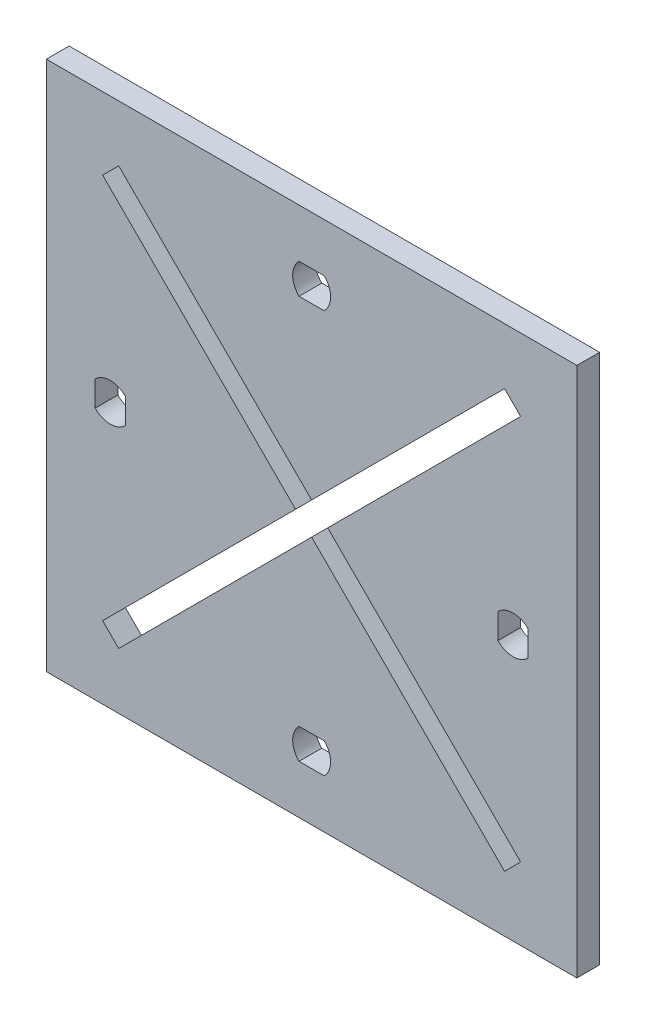
ISO-10303-21;
HEADER;
FILE_DESCRIPTION(('STEP AP214'),'2;1');
FILE_NAME('part.step','',(''),(''),'','','');
FILE_SCHEMA(('AUTOMOTIVE_DESIGN { 1 0 10303 214 1 1 1 1 }'));
ENDSEC;
DATA;
#1=APPLICATION_CONTEXT('core data for automotive mechanical design processes');
#2=APPLICATION_PROTOCOL_DEFINITION('international standard','automotive_design',2000,#1);
#3=PRODUCT_CONTEXT('',#1,'mechanical');
#4=PRODUCT('Part','Part','',(#3));
#5=PRODUCT_RELATED_PRODUCT_CATEGORY('part','',(#4));
#6=PRODUCT_DEFINITION_FORMATION('','',#4);
#7=PRODUCT_DEFINITION_CONTEXT('part definition',#1,'design');
#8=PRODUCT_DEFINITION('design','',#6,#7);
#9=PRODUCT_DEFINITION_SHAPE('','',#8);
#10=(LENGTH_UNIT() NAMED_UNIT(*) SI_UNIT(.MILLI.,.METRE.));
#11=(NAMED_UNIT(*) PLANE_ANGLE_UNIT() SI_UNIT($,.RADIAN.));
#12=(NAMED_UNIT(*) SI_UNIT($,.STERADIAN.) SOLID_ANGLE_UNIT());
#13=UNCERTAINTY_MEASURE_WITH_UNIT(LENGTH_MEASURE(1.E-05),#10,'distance_accuracy_value','');
#14=(GEOMETRIC_REPRESENTATION_CONTEXT(3) GLOBAL_UNCERTAINTY_ASSIGNED_CONTEXT((#13)) GLOBAL_UNIT_ASSIGNED_CONTEXT((#10,
#11,#12)) REPRESENTATION_CONTEXT('',''));
#15=CARTESIAN_POINT('',(0.,0.,0.));
#16=DIRECTION('',(0.,0.,1.));
#17=DIRECTION('',(1.,0.,0.));
#18=AXIS2_PLACEMENT_3D('',#15,#16,#17);
#19=CARTESIAN_POINT('',(26.9498063690037,0.,3.));
#20=DIRECTION('',(1.,0.,0.));
#21=DIRECTION('',(0.,0.,-1.));
#22=AXIS2_PLACEMENT_3D('',#19,#20,#21);
#23=PLANE('',#22);
#24=DIRECTION('',(0.,-1.,0.));
#25=VECTOR('',#24,1.);
#26=CARTESIAN_POINT('',(26.9498063690037,0.,0.));
#27=LINE('',#26,#25);
#28=CARTESIAN_POINT('',(26.9498063690037,-2.99948211574375,0.));
#29=VERTEX_POINT('',#28);
#30=CARTESIAN_POINT('',(26.9498063690037,-6.32849045633482,0.));
#31=VERTEX_POINT('',#30);
#32=EDGE_CURVE('E427',#29,#31,#27,.T.);
#33=ORIENTED_EDGE('',*,*,#32,.F.);
#34=DIRECTION('',(0.,0.,-1.));
#35=VECTOR('',#34,1.);
#36=CARTESIAN_POINT('',(26.9498063690037,-2.99948211574375,3.));
#37=LINE('',#36,#35);
#38=CARTESIAN_POINT('',(26.9498063690037,-2.99948211574375,3.));
#39=VERTEX_POINT('',#38);
#40=EDGE_CURVE('E11',#39,#29,#37,.T.);
#41=ORIENTED_EDGE('',*,*,#40,.F.);
#42=DIRECTION('',(0.,-1.,0.));
#43=VECTOR('',#42,1.);
#44=CARTESIAN_POINT('',(26.9498063690037,0.,3.));
#45=LINE('',#44,#43);
#46=CARTESIAN_POINT('',(26.9498063690037,-6.32849045633482,3.));
#47=VERTEX_POINT('',#46);
#48=EDGE_CURVE('E266',#39,#47,#45,.T.);
#49=ORIENTED_EDGE('',*,*,#48,.T.);
#50=DIRECTION('',(0.,0.,-1.));
#51=VECTOR('',#50,1.);
#52=CARTESIAN_POINT('',(26.9498063690037,-6.32849045633482,3.));
#53=LINE('',#52,#51);
#54=EDGE_CURVE('E56',#47,#31,#53,.T.);
#55=ORIENTED_EDGE('',*,*,#54,.T.);
#56=EDGE_LOOP('',(#33,#41,#49,#55));
#57=FACE_BOUND('',#56,.T.);
#58=ADVANCED_FACE('F37',(#57),#23,.T.);
#59=CARTESIAN_POINT('',(28.9498063690037,-4.97552233111767,3.));
#60=DIRECTION('',(0.,0.,-1.));
#61=DIRECTION('',(-1.,0.,0.));
#62=AXIS2_PLACEMENT_3D('',#59,#60,#61);
#63=CYLINDRICAL_SURFACE('',#62,2.81153604507839);
#64=CARTESIAN_POINT('',(28.9498063690037,-4.97552233111767,0.));
#65=DIRECTION('',(0.,0.,1.));
#66=DIRECTION('',(1.,0.,0.));
#67=AXIS2_PLACEMENT_3D('',#64,#65,#66);
#68=CIRCLE('',#67,2.81153604507839);
#69=CARTESIAN_POINT('',(30.9498063690037,-2.99948211574375,0.));
#70=VERTEX_POINT('',#69);
#71=EDGE_CURVE('E271',#29,#70,#68,.F.);
#72=ORIENTED_EDGE('',*,*,#71,.T.);
#73=DIRECTION('',(0.,0.,-1.));
#74=VECTOR('',#73,1.);
#75=CARTESIAN_POINT('',(30.9498063690037,-2.99948211574375,3.));
#76=LINE('',#75,#74);
#77=CARTESIAN_POINT('',(30.9498063690037,-2.99948211574375,3.));
#78=VERTEX_POINT('',#77);
#79=EDGE_CURVE('E47',#78,#70,#76,.T.);
#80=ORIENTED_EDGE('',*,*,#79,.F.);
#81=CARTESIAN_POINT('',(28.9498063690037,-4.97552233111767,3.));
#82=DIRECTION('',(0.,0.,1.));
#83=DIRECTION('',(1.,0.,0.));
#84=AXIS2_PLACEMENT_3D('',#81,#82,#83);
#85=CIRCLE('',#84,2.81153604507839);
#86=EDGE_CURVE('E261',#39,#78,#85,.F.);
#87=ORIENTED_EDGE('',*,*,#86,.F.);
#88=ORIENTED_EDGE('',*,*,#40,.T.);
#89=EDGE_LOOP('',(#72,#80,#87,#88));
#90=FACE_BOUND('',#89,.T.);
#91=ADVANCED_FACE('F269',(#90),#63,.F.);
#92=CARTESIAN_POINT('',(30.9498063690037,0.,3.));
#93=DIRECTION('',(1.,0.,0.));
#94=DIRECTION('',(0.,1.,0.));
#95=AXIS2_PLACEMENT_3D('',#92,#93,#94);
#96=PLANE('',#95);
#97=DIRECTION('',(0.,-1.,0.));
#98=VECTOR('',#97,1.);
#99=CARTESIAN_POINT('',(30.9498063690037,0.,0.));
#100=LINE('',#99,#98);
#101=CARTESIAN_POINT('',(30.9498063690037,-6.32849045633482,0.));
#102=VERTEX_POINT('',#101);
#103=EDGE_CURVE('E430',#70,#102,#100,.T.);
#104=ORIENTED_EDGE('',*,*,#103,.T.);
#105=DIRECTION('',(0.,0.,-1.));
#106=VECTOR('',#105,1.);
#107=CARTESIAN_POINT('',(30.9498063690037,-6.32849045633482,3.));
#108=LINE('',#107,#106);
#109=CARTESIAN_POINT('',(30.9498063690037,-6.32849045633482,3.));
#110=VERTEX_POINT('',#109);
#111=EDGE_CURVE('E154',#110,#102,#108,.T.);
#112=ORIENTED_EDGE('',*,*,#111,.F.);
#113=DIRECTION('',(0.,-1.,0.));
#114=VECTOR('',#113,1.);
#115=CARTESIAN_POINT('',(30.9498063690037,0.,3.));
#116=LINE('',#115,#114);
#117=EDGE_CURVE('E253',#78,#110,#116,.T.);
#118=ORIENTED_EDGE('',*,*,#117,.F.);
#119=ORIENTED_EDGE('',*,*,#79,.T.);
#120=EDGE_LOOP('',(#104,#112,#118,#119));
#121=FACE_BOUND('',#120,.T.);
#122=ADVANCED_FACE('F255',(#121),#96,.F.);
#123=CARTESIAN_POINT('',(37.3780317158852,0.,3.));
#124=DIRECTION('',(1.,0.,0.));
#125=DIRECTION('',(0.,0.,-1.));
#126=AXIS2_PLACEMENT_3D('',#123,#124,#125);
#127=PLANE('',#126);
#128=DIRECTION('',(0.,-1.,0.));
#129=VECTOR('',#128,1.);
#130=CARTESIAN_POINT('',(37.3780317158852,0.,0.));
#131=LINE('',#130,#129);
#132=CARTESIAN_POINT('',(37.3780317158852,30.3360137139607,0.));
#133=VERTEX_POINT('',#132);
#134=CARTESIAN_POINT('',(37.3780317158852,-39.6639862860393,0.));
#135=VERTEX_POINT('',#134);
#136=EDGE_CURVE('E415',#133,#135,#131,.T.);
#137=ORIENTED_EDGE('',*,*,#136,.F.);
#138=DIRECTION('',(0.,0.,-1.));
#139=VECTOR('',#138,1.);
#140=CARTESIAN_POINT('',(37.3780317158852,30.3360137139607,3.));
#141=LINE('',#140,#139);
#142=CARTESIAN_POINT('',(37.3780317158852,30.3360137139607,3.));
#143=VERTEX_POINT('',#142);
#144=EDGE_CURVE('E284',#143,#133,#141,.T.);
#145=ORIENTED_EDGE('',*,*,#144,.F.);
#146=DIRECTION('',(0.,-1.,0.));
#147=VECTOR('',#146,1.);
#148=CARTESIAN_POINT('',(37.3780317158852,0.,3.));
#149=LINE('',#148,#147);
#150=CARTESIAN_POINT('',(37.3780317158852,-39.6639862860393,3.));
#151=VERTEX_POINT('',#150);
#152=EDGE_CURVE('E492',#143,#151,#149,.T.);
#153=ORIENTED_EDGE('',*,*,#152,.T.);
#154=DIRECTION('',(0.,0.,-1.));
#155=VECTOR('',#154,1.);
#156=CARTESIAN_POINT('',(37.3780317158852,-39.6639862860393,3.));
#157=LINE('',#156,#155);
#158=EDGE_CURVE('E276',#151,#135,#157,.T.);
#159=ORIENTED_EDGE('',*,*,#158,.T.);
#160=EDGE_LOOP('',(#137,#145,#153,#159));
#161=FACE_BOUND('',#160,.T.);
#162=ADVANCED_FACE('F539',(#161),#127,.T.);
#163=CARTESIAN_POINT('',(0.,30.3360137139607,3.));
#164=DIRECTION('',(0.,1.,0.));
#165=DIRECTION('',(0.,0.,1.));
#166=AXIS2_PLACEMENT_3D('',#163,#164,#165);
#167=PLANE('',#166);
#168=DIRECTION('',(1.,0.,0.));
#169=VECTOR('',#168,1.);
#170=CARTESIAN_POINT('',(0.,30.3360137139607,0.));
#171=LINE('',#170,#169);
#172=CARTESIAN_POINT('',(-32.6219682841148,30.3360137139607,0.));
#173=VERTEX_POINT('',#172);
#174=EDGE_CURVE('E418',#173,#133,#171,.T.);
#175=ORIENTED_EDGE('',*,*,#174,.F.);
#176=DIRECTION('',(0.,0.,-1.));
#177=VECTOR('',#176,1.);
#178=CARTESIAN_POINT('',(-32.6219682841148,30.3360137139607,3.));
#179=LINE('',#178,#177);
#180=CARTESIAN_POINT('',(-32.6219682841148,30.3360137139607,3.));
#181=VERTEX_POINT('',#180);
#182=EDGE_CURVE('E282',#181,#173,#179,.T.);
#183=ORIENTED_EDGE('',*,*,#182,.F.);
#184=DIRECTION('',(1.,0.,0.));
#185=VECTOR('',#184,1.);
#186=CARTESIAN_POINT('',(0.,30.3360137139607,3.));
#187=LINE('',#186,#185);
#188=EDGE_CURVE('E495',#181,#143,#187,.T.);
#189=ORIENTED_EDGE('',*,*,#188,.T.);
#190=ORIENTED_EDGE('',*,*,#144,.T.);
#191=EDGE_LOOP('',(#175,#183,#189,#190));
#192=FACE_BOUND('',#191,.T.);
#193=ADVANCED_FACE('F535',(#192),#167,.T.);
#194=CARTESIAN_POINT('',(-32.6219682841148,0.,3.));
#195=DIRECTION('',(1.,0.,0.));
#196=DIRECTION('',(0.,1.,0.));
#197=AXIS2_PLACEMENT_3D('',#194,#195,#196);
#198=PLANE('',#197);
#199=DIRECTION('',(0.,-1.,0.));
#200=VECTOR('',#199,1.);
#201=CARTESIAN_POINT('',(-32.6219682841148,0.,0.));
#202=LINE('',#201,#200);
#203=CARTESIAN_POINT('',(-32.6219682841148,-39.6639862860393,0.));
#204=VERTEX_POINT('',#203);
#205=EDGE_CURVE('E421',#173,#204,#202,.T.);
#206=ORIENTED_EDGE('',*,*,#205,.T.);
#207=DIRECTION('',(0.,0.,-1.));
#208=VECTOR('',#207,1.);
#209=CARTESIAN_POINT('',(-32.6219682841148,-39.6639862860393,3.));
#210=LINE('',#209,#208);
#211=CARTESIAN_POINT('',(-32.6219682841148,-39.6639862860393,3.));
#212=VERTEX_POINT('',#211);
#213=EDGE_CURVE('E278',#212,#204,#210,.T.);
#214=ORIENTED_EDGE('',*,*,#213,.F.);
#215=DIRECTION('',(0.,-1.,0.));
#216=VECTOR('',#215,1.);
#217=CARTESIAN_POINT('',(-32.6219682841148,0.,3.));
#218=LINE('',#217,#216);
#219=EDGE_CURVE('E498',#181,#212,#218,.T.);
#220=ORIENTED_EDGE('',*,*,#219,.F.);
#221=ORIENTED_EDGE('',*,*,#182,.T.);
#222=EDGE_LOOP('',(#206,#214,#220,#221));
#223=FACE_BOUND('',#222,.T.);
#224=ADVANCED_FACE('F531',(#223),#198,.F.);
#225=CARTESIAN_POINT('',(4.58166917274206,-4.58166917274206,3.));
#226=DIRECTION('',(-0.707106781186547,0.707106781186547,0.));
#227=DIRECTION('',(-0.707106781186548,-0.707106781186548,0.));
#228=AXIS2_PLACEMENT_3D('',#225,#226,#227);
#229=PLANE('',#228);
#230=DIRECTION('',(0.707106781186548,0.707106781186548,0.));
#231=VECTOR('',#230,1.);
#232=CARTESIAN_POINT('',(4.58166917274206,-4.58166917274206,0.));
#233=LINE('',#232,#231);
#234=CARTESIAN_POINT('',(-23.0778124068305,-32.2411507523146,0.));
#235=VERTEX_POINT('',#234);
#236=CARTESIAN_POINT('',(2.37803171588518,-6.78530662959893,0.));
#237=VERTEX_POINT('',#236);
#238=EDGE_CURVE('E387',#235,#237,#233,.T.);
#239=ORIENTED_EDGE('',*,*,#238,.F.);
#240=DIRECTION('',(0.,0.,-1.));
#241=VECTOR('',#240,1.);
#242=CARTESIAN_POINT('',(-23.0778124068305,-32.2411507523146,3.));
#243=LINE('',#242,#241);
#244=CARTESIAN_POINT('',(-23.0778124068305,-32.2411507523146,3.));
#245=VERTEX_POINT('',#244);
#246=EDGE_CURVE('E279',#245,#235,#243,.T.);
#247=ORIENTED_EDGE('',*,*,#246,.F.);
#248=DIRECTION('',(0.707106781186548,0.707106781186548,0.));
#249=VECTOR('',#248,1.);
#250=CARTESIAN_POINT('',(4.58166917274206,-4.58166917274206,3.));
#251=LINE('',#250,#249);
#252=CARTESIAN_POINT('',(2.37803171588518,-6.78530662959893,3.));
#253=VERTEX_POINT('',#252);
#254=EDGE_CURVE('E465',#245,#253,#251,.T.);
#255=ORIENTED_EDGE('',*,*,#254,.T.);
#256=DIRECTION('',(0.,0.,-1.));
#257=VECTOR('',#256,1.);
#258=CARTESIAN_POINT('',(2.37803171588518,-6.78530662959893,3.));
#259=LINE('',#258,#257);
#260=EDGE_CURVE('E286',#253,#237,#259,.T.);
#261=ORIENTED_EDGE('',*,*,#260,.T.);
#262=EDGE_LOOP('',(#239,#247,#255,#261));
#263=FACE_BOUND('',#262,.T.);
#264=ADVANCED_FACE('F534',(#263),#229,.T.);
#265=CARTESIAN_POINT('',(-27.6594815795726,-27.6594815795726,3.));
#266=DIRECTION('',(0.707106781186548,0.707106781186547,0.));
#267=DIRECTION('',(-0.707106781186547,0.707106781186548,0.));
#268=AXIS2_PLACEMENT_3D('',#265,#266,#267);
#269=PLANE('',#268);
#270=DIRECTION('',(0.707106781186547,-0.707106781186548,0.));
#271=VECTOR('',#270,1.);
#272=CARTESIAN_POINT('',(-27.6594815795726,-27.6594815795726,0.));
#273=LINE('',#272,#271);
#274=CARTESIAN_POINT('',(-25.1991327503902,-30.119830408755,0.));
#275=VERTEX_POINT('',#274);
#276=EDGE_CURVE('E390',#275,#235,#273,.T.);
#277=ORIENTED_EDGE('',*,*,#276,.F.);
#278=DIRECTION('',(0.,0.,-1.));
#279=VECTOR('',#278,1.);
#280=CARTESIAN_POINT('',(-25.1991327503902,-30.119830408755,3.));
#281=LINE('',#280,#279);
#282=CARTESIAN_POINT('',(-25.1991327503902,-30.119830408755,3.));
#283=VERTEX_POINT('',#282);
#284=EDGE_CURVE('E311',#283,#275,#281,.T.);
#285=ORIENTED_EDGE('',*,*,#284,.F.);
#286=DIRECTION('',(0.707106781186547,-0.707106781186548,0.));
#287=VECTOR('',#286,1.);
#288=CARTESIAN_POINT('',(-27.6594815795726,-27.6594815795726,3.));
#289=LINE('',#288,#287);
#290=EDGE_CURVE('E468',#283,#245,#289,.T.);
#291=ORIENTED_EDGE('',*,*,#290,.T.);
#292=ORIENTED_EDGE('',*,*,#246,.T.);
#293=EDGE_LOOP('',(#277,#285,#291,#292));
#294=FACE_BOUND('',#293,.T.);
#295=ADVANCED_FACE('F576',(#294),#269,.T.);
#296=CARTESIAN_POINT('',(2.46034882918241,-2.46034882918241,3.));
#297=DIRECTION('',(0.707106781186547,-0.707106781186548,0.));
#298=DIRECTION('',(0.707106781186548,0.707106781186547,0.));
#299=AXIS2_PLACEMENT_3D('',#296,#297,#298);
#300=PLANE('',#299);
#301=DIRECTION('',(-0.707106781186548,-0.707106781186547,0.));
#302=VECTOR('',#301,1.);
#303=CARTESIAN_POINT('',(2.46034882918241,-2.46034882918241,0.));
#304=LINE('',#303,#302);
#305=CARTESIAN_POINT('',(0.25671137232553,-4.66398628603928,0.));
#306=VERTEX_POINT('',#305);
#307=EDGE_CURVE('E394',#306,#275,#304,.T.);
#308=ORIENTED_EDGE('',*,*,#307,.F.);
#309=DIRECTION('',(0.,0.,-1.));
#310=VECTOR('',#309,1.);
#311=CARTESIAN_POINT('',(0.25671137232553,-4.66398628603928,3.));
#312=LINE('',#311,#310);
#313=CARTESIAN_POINT('',(0.25671137232553,-4.66398628603928,3.));
#314=VERTEX_POINT('',#313);
#315=EDGE_CURVE('E309',#314,#306,#312,.T.);
#316=ORIENTED_EDGE('',*,*,#315,.F.);
#317=DIRECTION('',(-0.707106781186548,-0.707106781186547,0.));
#318=VECTOR('',#317,1.);
#319=CARTESIAN_POINT('',(2.46034882918241,-2.46034882918241,3.));
#320=LINE('',#319,#318);
#321=EDGE_CURVE('E472',#314,#283,#320,.T.);
#322=ORIENTED_EDGE('',*,*,#321,.T.);
#323=ORIENTED_EDGE('',*,*,#284,.T.);
#324=EDGE_LOOP('',(#308,#316,#322,#323));
#325=FACE_BOUND('',#324,.T.);
#326=ADVANCED_FACE('F571',(#325),#300,.T.);
#327=CARTESIAN_POINT('',(-2.20363745685688,-2.20363745685688,3.));
#328=DIRECTION('',(-0.707106781186547,-0.707106781186547,0.));
#329=DIRECTION('',(0.707106781186548,-0.707106781186548,0.));
#330=AXIS2_PLACEMENT_3D('',#327,#328,#329);
#331=PLANE('',#330);
#332=DIRECTION('',(-0.707106781186548,0.707106781186548,0.));
#333=VECTOR('',#332,1.);
#334=CARTESIAN_POINT('',(-2.20363745685688,-2.20363745685688,0.));
#335=LINE('',#334,#333);
#336=CARTESIAN_POINT('',(-25.1991327503902,20.7918578366764,0.));
#337=VERTEX_POINT('',#336);
#338=EDGE_CURVE('E397',#306,#337,#335,.T.);
#339=ORIENTED_EDGE('',*,*,#338,.T.);
#340=DIRECTION('',(0.,0.,-1.));
#341=VECTOR('',#340,1.);
#342=CARTESIAN_POINT('',(-25.1991327503902,20.7918578366764,3.));
#343=LINE('',#342,#341);
#344=CARTESIAN_POINT('',(-25.1991327503902,20.7918578366764,3.));
#345=VERTEX_POINT('',#344);
#346=EDGE_CURVE('E306',#345,#337,#343,.T.);
#347=ORIENTED_EDGE('',*,*,#346,.F.);
#348=DIRECTION('',(-0.707106781186548,0.707106781186548,0.));
#349=VECTOR('',#348,1.);
#350=CARTESIAN_POINT('',(-2.20363745685688,-2.20363745685688,3.));
#351=LINE('',#350,#349);
#352=EDGE_CURVE('E475',#314,#345,#351,.T.);
#353=ORIENTED_EDGE('',*,*,#352,.F.);
#354=ORIENTED_EDGE('',*,*,#315,.T.);
#355=EDGE_LOOP('',(#339,#347,#353,#354));
#356=FACE_BOUND('',#355,.T.);
#357=ADVANCED_FACE('F548',(#356),#331,.F.);
#358=CARTESIAN_POINT('',(-22.9954952935333,22.9954952935333,3.));
#359=DIRECTION('',(-0.707106781186548,0.707106781186547,0.));
#360=DIRECTION('',(-0.707106781186547,-0.707106781186548,0.));
#361=AXIS2_PLACEMENT_3D('',#358,#359,#360);
#362=PLANE('',#361);
#363=DIRECTION('',(0.707106781186547,0.707106781186548,0.));
#364=VECTOR('',#363,1.);
#365=CARTESIAN_POINT('',(-22.9954952935333,22.9954952935333,0.));
#366=LINE('',#365,#364);
#367=CARTESIAN_POINT('',(-23.0778124068306,22.9131781802361,0.));
#368=VERTEX_POINT('',#367);
#369=EDGE_CURVE('E401',#337,#368,#366,.T.);
#370=ORIENTED_EDGE('',*,*,#369,.T.);
#371=DIRECTION('',(0.,0.,-1.));
#372=VECTOR('',#371,1.);
#373=CARTESIAN_POINT('',(-23.0778124068306,22.9131781802361,3.));
#374=LINE('',#373,#372);
#375=CARTESIAN_POINT('',(-23.0778124068306,22.9131781802361,3.));
#376=VERTEX_POINT('',#375);
#377=EDGE_CURVE('E303',#376,#368,#374,.T.);
#378=ORIENTED_EDGE('',*,*,#377,.F.);
#379=DIRECTION('',(0.707106781186547,0.707106781186548,0.));
#380=VECTOR('',#379,1.);
#381=CARTESIAN_POINT('',(-22.9954952935333,22.9954952935333,3.));
#382=LINE('',#381,#380);
#383=EDGE_CURVE('E479',#345,#376,#382,.T.);
#384=ORIENTED_EDGE('',*,*,#383,.F.);
#385=ORIENTED_EDGE('',*,*,#346,.T.);
#386=EDGE_LOOP('',(#370,#378,#384,#385));
#387=FACE_BOUND('',#386,.T.);
#388=ADVANCED_FACE('F572',(#387),#362,.F.);
#389=CARTESIAN_POINT('',(-0.0823171132972328,-0.0823171132972329,3.));
#390=DIRECTION('',(0.707106781186547,0.707106781186548,0.));
#391=DIRECTION('',(-0.707106781186548,0.707106781186547,0.));
#392=AXIS2_PLACEMENT_3D('',#389,#390,#391);
#393=PLANE('',#392);
#394=DIRECTION('',(0.707106781186548,-0.707106781186547,0.));
#395=VECTOR('',#394,1.);
#396=CARTESIAN_POINT('',(-0.0823171132972328,-0.0823171132972329,0.));
#397=LINE('',#396,#395);
#398=CARTESIAN_POINT('',(2.37803171588518,-2.54266594247964,0.));
#399=VERTEX_POINT('',#398);
#400=EDGE_CURVE('E405',#368,#399,#397,.T.);
#401=ORIENTED_EDGE('',*,*,#400,.T.);
#402=DIRECTION('',(0.,0.,-1.));
#403=VECTOR('',#402,1.);
#404=CARTESIAN_POINT('',(2.37803171588518,-2.54266594247964,3.));
#405=LINE('',#404,#403);
#406=CARTESIAN_POINT('',(2.37803171588518,-2.54266594247964,3.));
#407=VERTEX_POINT('',#406);
#408=EDGE_CURVE('E301',#407,#399,#405,.T.);
#409=ORIENTED_EDGE('',*,*,#408,.F.);
#410=DIRECTION('',(0.707106781186548,-0.707106781186547,0.));
#411=VECTOR('',#410,1.);
#412=CARTESIAN_POINT('',(-0.0823171132972328,-0.0823171132972329,3.));
#413=LINE('',#412,#411);
#414=EDGE_CURVE('E483',#376,#407,#413,.T.);
#415=ORIENTED_EDGE('',*,*,#414,.F.);
#416=ORIENTED_EDGE('',*,*,#377,.T.);
#417=EDGE_LOOP('',(#401,#409,#415,#416));
#418=FACE_BOUND('',#417,.T.);
#419=ADVANCED_FACE('F559',(#418),#393,.F.);
#420=CARTESIAN_POINT('',(27.8338758386009,22.9131781802361,0.));
#421=VERTEX_POINT('',#420);
#422=EDGE_CURVE('E398',#421,#399,#304,.T.);
#423=ORIENTED_EDGE('',*,*,#422,.F.);
#424=DIRECTION('',(0.,0.,-1.));
#425=VECTOR('',#424,1.);
#426=CARTESIAN_POINT('',(27.8338758386009,22.9131781802361,3.));
#427=LINE('',#426,#425);
#428=CARTESIAN_POINT('',(27.8338758386009,22.9131781802361,3.));
#429=VERTEX_POINT('',#428);
#430=EDGE_CURVE('E299',#429,#421,#427,.T.);
#431=ORIENTED_EDGE('',*,*,#430,.F.);
#432=EDGE_CURVE('E476',#429,#407,#320,.T.);
#433=ORIENTED_EDGE('',*,*,#432,.T.);
#434=ORIENTED_EDGE('',*,*,#408,.T.);
#435=EDGE_LOOP('',(#423,#431,#433,#434));
#436=FACE_BOUND('',#435,.T.);
#437=ADVANCED_FACE('F566',(#436),#300,.T.);
#438=CARTESIAN_POINT('',(25.3735270094185,25.3735270094185,3.));
#439=DIRECTION('',(-0.707106781186548,-0.707106781186547,0.));
#440=DIRECTION('',(0.707106781186547,-0.707106781186548,0.));
#441=AXIS2_PLACEMENT_3D('',#438,#439,#440);
#442=PLANE('',#441);
#443=DIRECTION('',(-0.707106781186547,0.707106781186548,0.));
#444=VECTOR('',#443,1.);
#445=CARTESIAN_POINT('',(25.3735270094185,25.3735270094185,0.));
#446=LINE('',#445,#444);
#447=CARTESIAN_POINT('',(29.9551961821605,20.7918578366764,0.));
#448=VERTEX_POINT('',#447);
#449=EDGE_CURVE('E409',#448,#421,#446,.T.);
#450=ORIENTED_EDGE('',*,*,#449,.F.);
#451=DIRECTION('',(0.,0.,-1.));
#452=VECTOR('',#451,1.);
#453=CARTESIAN_POINT('',(29.9551961821605,20.7918578366764,3.));
#454=LINE('',#453,#452);
#455=CARTESIAN_POINT('',(29.9551961821605,20.7918578366764,3.));
#456=VERTEX_POINT('',#455);
#457=EDGE_CURVE('E297',#456,#448,#454,.T.);
#458=ORIENTED_EDGE('',*,*,#457,.F.);
#459=DIRECTION('',(-0.707106781186547,0.707106781186548,0.));
#460=VECTOR('',#459,1.);
#461=CARTESIAN_POINT('',(25.3735270094185,25.3735270094185,3.));
#462=LINE('',#461,#460);
#463=EDGE_CURVE('E486',#456,#429,#462,.T.);
#464=ORIENTED_EDGE('',*,*,#463,.T.);
#465=ORIENTED_EDGE('',*,*,#430,.T.);
#466=EDGE_LOOP('',(#450,#458,#464,#465));
#467=FACE_BOUND('',#466,.T.);
#468=ADVANCED_FACE('F562',(#467),#442,.T.);
#469=CARTESIAN_POINT('',(4.49935205944482,-4.66398628603929,0.));
#470=VERTEX_POINT('',#469);
#471=EDGE_CURVE('E391',#470,#448,#233,.T.);
#472=ORIENTED_EDGE('',*,*,#471,.F.);
#473=DIRECTION('',(0.,0.,-1.));
#474=VECTOR('',#473,1.);
#475=CARTESIAN_POINT('',(4.49935205944482,-4.66398628603929,3.));
#476=LINE('',#475,#474);
#477=CARTESIAN_POINT('',(4.49935205944482,-4.66398628603929,3.));
#478=VERTEX_POINT('',#477);
#479=EDGE_CURVE('E295',#478,#470,#476,.T.);
#480=ORIENTED_EDGE('',*,*,#479,.F.);
#481=EDGE_CURVE('E469',#478,#456,#251,.T.);
#482=ORIENTED_EDGE('',*,*,#481,.T.);
#483=ORIENTED_EDGE('',*,*,#457,.T.);
#484=EDGE_LOOP('',(#472,#480,#482,#483));
#485=FACE_BOUND('',#484,.T.);
#486=ADVANCED_FACE('F557',(#485),#229,.T.);
#487=CARTESIAN_POINT('',(29.9551961821605,-30.119830408755,0.));
#488=VERTEX_POINT('',#487);
#489=EDGE_CURVE('E408',#470,#488,#397,.T.);
#490=ORIENTED_EDGE('',*,*,#489,.T.);
#491=DIRECTION('',(0.,0.,-1.));
#492=VECTOR('',#491,1.);
#493=CARTESIAN_POINT('',(29.9551961821605,-30.119830408755,3.));
#494=LINE('',#493,#492);
#495=CARTESIAN_POINT('',(29.9551961821605,-30.119830408755,3.));
#496=VERTEX_POINT('',#495);
#497=EDGE_CURVE('E292',#496,#488,#494,.T.);
#498=ORIENTED_EDGE('',*,*,#497,.F.);
#499=EDGE_CURVE('E485',#478,#496,#413,.T.);
#500=ORIENTED_EDGE('',*,*,#499,.F.);
#501=ORIENTED_EDGE('',*,*,#479,.T.);
#502=EDGE_LOOP('',(#490,#498,#500,#501));
#503=FACE_BOUND('',#502,.T.);
#504=ADVANCED_FACE('F553',(#503),#393,.F.);
#505=CARTESIAN_POINT('',(30.0375132954578,-30.0375132954577,3.));
#506=DIRECTION('',(0.707106781186548,-0.707106781186547,0.));
#507=DIRECTION('',(0.707106781186547,0.707106781186548,0.));
#508=AXIS2_PLACEMENT_3D('',#505,#506,#507);
#509=PLANE('',#508);
#510=DIRECTION('',(-0.707106781186547,-0.707106781186548,0.));
#511=VECTOR('',#510,1.);
#512=CARTESIAN_POINT('',(30.0375132954578,-30.0375132954577,0.));
#513=LINE('',#512,#511);
#514=CARTESIAN_POINT('',(27.8338758386009,-32.2411507523146,0.));
#515=VERTEX_POINT('',#514);
#516=EDGE_CURVE('E412',#488,#515,#513,.T.);
#517=ORIENTED_EDGE('',*,*,#516,.T.);
#518=DIRECTION('',(0.,0.,-1.));
#519=VECTOR('',#518,1.);
#520=CARTESIAN_POINT('',(27.8338758386009,-32.2411507523146,3.));
#521=LINE('',#520,#519);
#522=CARTESIAN_POINT('',(27.8338758386009,-32.2411507523146,3.));
#523=VERTEX_POINT('',#522);
#524=EDGE_CURVE('E288',#523,#515,#521,.T.);
#525=ORIENTED_EDGE('',*,*,#524,.F.);
#526=DIRECTION('',(-0.707106781186547,-0.707106781186548,0.));
#527=VECTOR('',#526,1.);
#528=CARTESIAN_POINT('',(30.0375132954578,-30.0375132954577,3.));
#529=LINE('',#528,#527);
#530=EDGE_CURVE('E489',#496,#523,#529,.T.);
#531=ORIENTED_EDGE('',*,*,#530,.F.);
#532=ORIENTED_EDGE('',*,*,#497,.T.);
#533=EDGE_LOOP('',(#517,#525,#531,#532));
#534=FACE_BOUND('',#533,.T.);
#535=ADVANCED_FACE('F549',(#534),#509,.F.);
#536=CARTESIAN_POINT('',(2.68956776096356,-31.2357609391578,3.));
#537=DIRECTION('',(0.,0.,-1.));
#538=DIRECTION('',(-1.,0.,0.));
#539=AXIS2_PLACEMENT_3D('',#536,#537,#538);
#540=CYLINDRICAL_SURFACE('',#539,2.81153604507838);
#541=CARTESIAN_POINT('',(2.68956776096356,-31.2357609391578,0.));
#542=DIRECTION('',(0.,0.,1.));
#543=DIRECTION('',(1.,0.,0.));
#544=AXIS2_PLACEMENT_3D('',#541,#542,#543);
#545=CIRCLE('',#544,2.81153604507838);
#546=CARTESIAN_POINT('',(0.713527545589648,-29.2357609391578,0.));
#547=VERTEX_POINT('',#546);
#548=CARTESIAN_POINT('',(0.713527545589631,-33.2357609391578,0.));
#549=VERTEX_POINT('',#548);
#550=EDGE_CURVE('E375',#547,#549,#545,.T.);
#551=ORIENTED_EDGE('',*,*,#550,.F.);
#552=DIRECTION('',(0.,0.,-1.));
#553=VECTOR('',#552,1.);
#554=CARTESIAN_POINT('',(0.713527545589648,-29.2357609391578,3.));
#555=LINE('',#554,#553);
#556=CARTESIAN_POINT('',(0.713527545589648,-29.2357609391578,3.));
#557=VERTEX_POINT('',#556);
#558=EDGE_CURVE('E289',#557,#547,#555,.T.);
#559=ORIENTED_EDGE('',*,*,#558,.F.);
#560=CARTESIAN_POINT('',(2.68956776096356,-31.2357609391578,3.));
#561=DIRECTION('',(0.,0.,1.));
#562=DIRECTION('',(1.,0.,0.));
#563=AXIS2_PLACEMENT_3D('',#560,#561,#562);
#564=CIRCLE('',#563,2.81153604507838);
#565=CARTESIAN_POINT('',(0.713527545589631,-33.2357609391578,3.));
#566=VERTEX_POINT('',#565);
#567=EDGE_CURVE('E454',#557,#566,#564,.T.);
#568=ORIENTED_EDGE('',*,*,#567,.T.);
#569=DIRECTION('',(0.,0.,-1.));
#570=VECTOR('',#569,1.);
#571=CARTESIAN_POINT('',(0.713527545589631,-33.2357609391578,3.));
#572=LINE('',#571,#570);
#573=EDGE_CURVE('E314',#566,#549,#572,.T.);
#574=ORIENTED_EDGE('',*,*,#573,.T.);
#575=EDGE_LOOP('',(#551,#559,#568,#574));
#576=FACE_BOUND('',#575,.T.);
#577=ADVANCED_FACE('F552',(#576),#540,.F.);
#578=CARTESIAN_POINT('',(0.,-29.2357609391578,3.));
#579=DIRECTION('',(0.,1.,0.));
#580=DIRECTION('',(-1.,0.,0.));
#581=AXIS2_PLACEMENT_3D('',#578,#579,#580);
#582=PLANE('',#581);
#583=DIRECTION('',(1.,0.,0.));
#584=VECTOR('',#583,1.);
#585=CARTESIAN_POINT('',(0.,-29.2357609391578,0.));
#586=LINE('',#585,#584);
#587=CARTESIAN_POINT('',(4.04253588618071,-29.2357609391578,0.));
#588=VERTEX_POINT('',#587);
#589=EDGE_CURVE('E378',#547,#588,#586,.T.);
#590=ORIENTED_EDGE('',*,*,#589,.T.);
#591=DIRECTION('',(0.,0.,-1.));
#592=VECTOR('',#591,1.);
#593=CARTESIAN_POINT('',(4.04253588618071,-29.2357609391578,3.));
#594=LINE('',#593,#592);
#595=CARTESIAN_POINT('',(4.04253588618071,-29.2357609391578,3.));
#596=VERTEX_POINT('',#595);
#597=EDGE_CURVE('E319',#596,#588,#594,.T.);
#598=ORIENTED_EDGE('',*,*,#597,.F.);
#599=DIRECTION('',(1.,0.,0.));
#600=VECTOR('',#599,1.);
#601=CARTESIAN_POINT('',(0.,-29.2357609391578,3.));
#602=LINE('',#601,#600);
#603=EDGE_CURVE('E457',#557,#596,#602,.T.);
#604=ORIENTED_EDGE('',*,*,#603,.F.);
#605=ORIENTED_EDGE('',*,*,#558,.T.);
#606=EDGE_LOOP('',(#590,#598,#604,#605));
#607=FACE_BOUND('',#606,.T.);
#608=ADVANCED_FACE('F587',(#607),#582,.F.);
#609=CARTESIAN_POINT('',(2.06649567080679,-31.2357609391578,3.));
#610=DIRECTION('',(0.,0.,-1.));
#611=DIRECTION('',(-1.,0.,0.));
#612=AXIS2_PLACEMENT_3D('',#609,#610,#611);
#613=CYLINDRICAL_SURFACE('',#612,2.8115360450784);
#614=CARTESIAN_POINT('',(2.06649567080679,-31.2357609391578,0.));
#615=DIRECTION('',(0.,0.,1.));
#616=DIRECTION('',(1.,0.,0.));
#617=AXIS2_PLACEMENT_3D('',#614,#615,#616);
#618=CIRCLE('',#617,2.8115360450784);
#619=CARTESIAN_POINT('',(4.04253588618071,-33.2357609391578,0.));
#620=VERTEX_POINT('',#619);
#621=EDGE_CURVE('E381',#588,#620,#618,.F.);
#622=ORIENTED_EDGE('',*,*,#621,.T.);
#623=DIRECTION('',(0.,0.,-1.));
#624=VECTOR('',#623,1.);
#625=CARTESIAN_POINT('',(4.04253588618071,-33.2357609391578,3.));
#626=LINE('',#625,#624);
#627=CARTESIAN_POINT('',(4.04253588618071,-33.2357609391578,3.));
#628=VERTEX_POINT('',#627);
#629=EDGE_CURVE('E316',#628,#620,#626,.T.);
#630=ORIENTED_EDGE('',*,*,#629,.F.);
#631=CARTESIAN_POINT('',(2.06649567080679,-31.2357609391578,3.));
#632=DIRECTION('',(0.,0.,1.));
#633=DIRECTION('',(1.,0.,0.));
#634=AXIS2_PLACEMENT_3D('',#631,#632,#633);
#635=CIRCLE('',#634,2.8115360450784);
#636=EDGE_CURVE('E460',#596,#628,#635,.F.);
#637=ORIENTED_EDGE('',*,*,#636,.F.);
#638=ORIENTED_EDGE('',*,*,#597,.T.);
#639=EDGE_LOOP('',(#622,#630,#637,#638));
#640=FACE_BOUND('',#639,.T.);
#641=ADVANCED_FACE('F583',(#640),#613,.F.);
#642=CARTESIAN_POINT('',(-24.1937429372333,-4.97552233111769,3.));
#643=DIRECTION('',(0.,0.,-1.));
#644=DIRECTION('',(-1.,0.,0.));
#645=AXIS2_PLACEMENT_3D('',#642,#643,#644);
#646=CYLINDRICAL_SURFACE('',#645,2.81153604507839);
#647=CARTESIAN_POINT('',(-24.1937429372333,-4.97552233111769,0.));
#648=DIRECTION('',(0.,0.,1.));
#649=DIRECTION('',(1.,0.,0.));
#650=AXIS2_PLACEMENT_3D('',#647,#648,#649);
#651=CIRCLE('',#650,2.81153604507839);
#652=CARTESIAN_POINT('',(-22.1937429372333,-2.99948211574376,0.));
#653=VERTEX_POINT('',#652);
#654=CARTESIAN_POINT('',(-26.1937429372333,-2.99948211574376,0.));
#655=VERTEX_POINT('',#654);
#656=EDGE_CURVE('E363',#653,#655,#651,.T.);
#657=ORIENTED_EDGE('',*,*,#656,.F.);
#658=DIRECTION('',(0.,0.,-1.));
#659=VECTOR('',#658,1.);
#660=CARTESIAN_POINT('',(-22.1937429372333,-2.99948211574376,3.));
#661=LINE('',#660,#659);
#662=CARTESIAN_POINT('',(-22.1937429372333,-2.99948211574376,3.));
#663=VERTEX_POINT('',#662);
#664=EDGE_CURVE('E317',#663,#653,#661,.T.);
#665=ORIENTED_EDGE('',*,*,#664,.F.);
#666=CARTESIAN_POINT('',(-24.1937429372333,-4.97552233111769,3.));
#667=DIRECTION('',(0.,0.,1.));
#668=DIRECTION('',(1.,0.,0.));
#669=AXIS2_PLACEMENT_3D('',#666,#667,#668);
#670=CIRCLE('',#669,2.81153604507839);
#671=CARTESIAN_POINT('',(-26.1937429372333,-2.99948211574376,3.));
#672=VERTEX_POINT('',#671);
#673=EDGE_CURVE('E443',#663,#672,#670,.T.);
#674=ORIENTED_EDGE('',*,*,#673,.T.);
#675=DIRECTION('',(0.,0.,-1.));
#676=VECTOR('',#675,1.);
#677=CARTESIAN_POINT('',(-26.1937429372333,-2.99948211574376,3.));
#678=LINE('',#677,#676);
#679=EDGE_CURVE('E323',#672,#655,#678,.T.);
#680=ORIENTED_EDGE('',*,*,#679,.T.);
#681=EDGE_LOOP('',(#657,#665,#674,#680));
#682=FACE_BOUND('',#681,.T.);
#683=ADVANCED_FACE('F586',(#682),#646,.F.);
#684=CARTESIAN_POINT('',(-22.1937429372333,0.,3.));
#685=DIRECTION('',(1.,0.,0.));
#686=DIRECTION('',(0.,0.,-1.));
#687=AXIS2_PLACEMENT_3D('',#684,#685,#686);
#688=PLANE('',#687);
#689=DIRECTION('',(0.,-1.,0.));
#690=VECTOR('',#689,1.);
#691=CARTESIAN_POINT('',(-22.1937429372333,0.,0.));
#692=LINE('',#691,#690);
#693=CARTESIAN_POINT('',(-22.1937429372333,-6.32849045633483,0.));
#694=VERTEX_POINT('',#693);
#695=EDGE_CURVE('E366',#653,#694,#692,.T.);
#696=ORIENTED_EDGE('',*,*,#695,.T.);
#697=DIRECTION('',(0.,0.,-1.));
#698=VECTOR('',#697,1.);
#699=CARTESIAN_POINT('',(-22.1937429372333,-6.32849045633483,3.));
#700=LINE('',#699,#698);
#701=CARTESIAN_POINT('',(-22.1937429372333,-6.32849045633483,3.));
#702=VERTEX_POINT('',#701);
#703=EDGE_CURVE('E327',#702,#694,#700,.T.);
#704=ORIENTED_EDGE('',*,*,#703,.F.);
#705=DIRECTION('',(0.,-1.,0.));
#706=VECTOR('',#705,1.);
#707=CARTESIAN_POINT('',(-22.1937429372333,0.,3.));
#708=LINE('',#707,#706);
#709=EDGE_CURVE('E446',#663,#702,#708,.T.);
#710=ORIENTED_EDGE('',*,*,#709,.F.);
#711=ORIENTED_EDGE('',*,*,#664,.T.);
#712=EDGE_LOOP('',(#696,#704,#710,#711));
#713=FACE_BOUND('',#712,.T.);
#714=ADVANCED_FACE('F601',(#713),#688,.F.);
#715=CARTESIAN_POINT('',(-24.1937429372333,-4.35245024096091,3.));
#716=DIRECTION('',(0.,0.,-1.));
#717=DIRECTION('',(-1.,0.,0.));
#718=AXIS2_PLACEMENT_3D('',#715,#716,#717);
#719=CYLINDRICAL_SURFACE('',#718,2.81153604507839);
#720=CARTESIAN_POINT('',(-24.1937429372333,-4.35245024096091,0.));
#721=DIRECTION('',(0.,0.,1.));
#722=DIRECTION('',(1.,0.,0.));
#723=AXIS2_PLACEMENT_3D('',#720,#721,#722);
#724=CIRCLE('',#723,2.81153604507839);
#725=CARTESIAN_POINT('',(-26.1937429372333,-6.32849045633483,0.));
#726=VERTEX_POINT('',#725);
#727=EDGE_CURVE('E369',#694,#726,#724,.F.);
#728=ORIENTED_EDGE('',*,*,#727,.T.);
#729=DIRECTION('',(0.,0.,-1.));
#730=VECTOR('',#729,1.);
#731=CARTESIAN_POINT('',(-26.1937429372333,-6.32849045633483,3.));
#732=LINE('',#731,#730);
#733=CARTESIAN_POINT('',(-26.1937429372333,-6.32849045633483,3.));
#734=VERTEX_POINT('',#733);
#735=EDGE_CURVE('E325',#734,#726,#732,.T.);
#736=ORIENTED_EDGE('',*,*,#735,.F.);
#737=CARTESIAN_POINT('',(-24.1937429372333,-4.35245024096091,3.));
#738=DIRECTION('',(0.,0.,1.));
#739=DIRECTION('',(1.,0.,0.));
#740=AXIS2_PLACEMENT_3D('',#737,#738,#739);
#741=CIRCLE('',#740,2.81153604507839);
#742=EDGE_CURVE('E449',#702,#734,#741,.F.);
#743=ORIENTED_EDGE('',*,*,#742,.F.);
#744=ORIENTED_EDGE('',*,*,#703,.T.);
#745=EDGE_LOOP('',(#728,#736,#743,#744));
#746=FACE_BOUND('',#745,.T.);
#747=ADVANCED_FACE('F598',(#746),#719,.F.);
#748=CARTESIAN_POINT('',(2.06649567080679,21.9077883670792,3.));
#749=DIRECTION('',(0.,0.,-1.));
#750=DIRECTION('',(-1.,0.,0.));
#751=AXIS2_PLACEMENT_3D('',#748,#749,#750);
#752=CYLINDRICAL_SURFACE('',#751,2.81153604507839);
#753=CARTESIAN_POINT('',(2.06649567080679,21.9077883670792,0.));
#754=DIRECTION('',(0.,0.,1.));
#755=DIRECTION('',(1.,0.,0.));
#756=AXIS2_PLACEMENT_3D('',#753,#754,#755);
#757=CIRCLE('',#756,2.81153604507839);
#758=CARTESIAN_POINT('',(4.04253588618071,19.9077883670792,0.));
#759=VERTEX_POINT('',#758);
#760=CARTESIAN_POINT('',(4.04253588618071,23.9077883670792,0.));
#761=VERTEX_POINT('',#760);
#762=EDGE_CURVE('E348',#759,#761,#757,.T.);
#763=ORIENTED_EDGE('',*,*,#762,.F.);
#764=DIRECTION('',(0.,0.,-1.));
#765=VECTOR('',#764,1.);
#766=CARTESIAN_POINT('',(4.04253588618071,19.9077883670792,3.));
#767=LINE('',#766,#765);
#768=CARTESIAN_POINT('',(4.04253588618071,19.9077883670792,3.));
#769=VERTEX_POINT('',#768);
#770=EDGE_CURVE('E41',#769,#759,#767,.T.);
#771=ORIENTED_EDGE('',*,*,#770,.F.);
#772=CARTESIAN_POINT('',(2.06649567080679,21.9077883670792,3.));
#773=DIRECTION('',(0.,0.,1.));
#774=DIRECTION('',(1.,0.,0.));
#775=AXIS2_PLACEMENT_3D('',#772,#773,#774);
#776=CIRCLE('',#775,2.81153604507839);
#777=CARTESIAN_POINT('',(4.04253588618071,23.9077883670792,3.));
#778=VERTEX_POINT('',#777);
#779=EDGE_CURVE('E434',#769,#778,#776,.T.);
#780=ORIENTED_EDGE('',*,*,#779,.T.);
#781=DIRECTION('',(0.,0.,-1.));
#782=VECTOR('',#781,1.);
#783=CARTESIAN_POINT('',(4.04253588618071,23.9077883670792,3.));
#784=LINE('',#783,#782);
#785=EDGE_CURVE('E331',#778,#761,#784,.T.);
#786=ORIENTED_EDGE('',*,*,#785,.T.);
#787=EDGE_LOOP('',(#763,#771,#780,#786));
#788=FACE_BOUND('',#787,.T.);
#789=ADVANCED_FACE('F39',(#788),#752,.F.);
#790=CARTESIAN_POINT('',(0.,19.9077883670792,3.));
#791=DIRECTION('',(0.,1.,0.));
#792=DIRECTION('',(-1.,0.,0.));
#793=AXIS2_PLACEMENT_3D('',#790,#791,#792);
#794=PLANE('',#793);
#795=DIRECTION('',(1.,0.,0.));
#796=VECTOR('',#795,1.);
#797=CARTESIAN_POINT('',(0.,19.9077883670792,0.));
#798=LINE('',#797,#796);
#799=CARTESIAN_POINT('',(0.713527545589655,19.9077883670792,0.));
#800=VERTEX_POINT('',#799);
#801=EDGE_CURVE('E344',#800,#759,#798,.T.);
#802=ORIENTED_EDGE('',*,*,#801,.F.);
#803=DIRECTION('',(0.,0.,-1.));
#804=VECTOR('',#803,1.);
#805=CARTESIAN_POINT('',(0.713527545589655,19.9077883670792,3.));
#806=LINE('',#805,#804);
#807=CARTESIAN_POINT('',(0.713527545589655,19.9077883670792,3.));
#808=VERTEX_POINT('',#807);
#809=EDGE_CURVE('E335',#808,#800,#806,.T.);
#810=ORIENTED_EDGE('',*,*,#809,.F.);
#811=DIRECTION('',(1.,0.,0.));
#812=VECTOR('',#811,1.);
#813=CARTESIAN_POINT('',(0.,19.9077883670792,3.));
#814=LINE('',#813,#812);
#815=EDGE_CURVE('E346',#808,#769,#814,.T.);
#816=ORIENTED_EDGE('',*,*,#815,.T.);
#817=ORIENTED_EDGE('',*,*,#770,.T.);
#818=EDGE_LOOP('',(#802,#810,#816,#817));
#819=FACE_BOUND('',#818,.T.);
#820=ADVANCED_FACE('F342',(#819),#794,.T.);
#821=CARTESIAN_POINT('',(2.68956776096357,21.9077883670792,3.));
#822=DIRECTION('',(0.,0.,-1.));
#823=DIRECTION('',(-1.,0.,0.));
#824=AXIS2_PLACEMENT_3D('',#821,#822,#823);
#825=CYLINDRICAL_SURFACE('',#824,2.81153604507838);
#826=CARTESIAN_POINT('',(2.68956776096357,21.9077883670792,0.));
#827=DIRECTION('',(0.,0.,1.));
#828=DIRECTION('',(1.,0.,0.));
#829=AXIS2_PLACEMENT_3D('',#826,#827,#828);
#830=CIRCLE('',#829,2.81153604507838);
#831=CARTESIAN_POINT('',(0.713527545589645,23.9077883670792,0.));
#832=VERTEX_POINT('',#831);
#833=EDGE_CURVE('E356',#800,#832,#830,.F.);
#834=ORIENTED_EDGE('',*,*,#833,.T.);
#835=DIRECTION('',(0.,0.,-1.));
#836=VECTOR('',#835,1.);
#837=CARTESIAN_POINT('',(0.713527545589645,23.9077883670792,3.));
#838=LINE('',#837,#836);
#839=CARTESIAN_POINT('',(0.713527545589645,23.9077883670792,3.));
#840=VERTEX_POINT('',#839);
#841=EDGE_CURVE('E333',#840,#832,#838,.T.);
#842=ORIENTED_EDGE('',*,*,#841,.F.);
#843=CARTESIAN_POINT('',(2.68956776096357,21.9077883670792,3.));
#844=DIRECTION('',(0.,0.,1.));
#845=DIRECTION('',(1.,0.,0.));
#846=AXIS2_PLACEMENT_3D('',#843,#844,#845);
#847=CIRCLE('',#846,2.81153604507838);
#848=EDGE_CURVE('E437',#808,#840,#847,.F.);
#849=ORIENTED_EDGE('',*,*,#848,.F.);
#850=ORIENTED_EDGE('',*,*,#809,.T.);
#851=EDGE_LOOP('',(#834,#842,#849,#850));
#852=FACE_BOUND('',#851,.T.);
#853=ADVANCED_FACE('F529',(#852),#825,.F.);
#854=CARTESIAN_POINT('',(0.,-39.6639862860393,3.));
#855=DIRECTION('',(0.,1.,0.));
#856=DIRECTION('',(-1.,0.,0.));
#857=AXIS2_PLACEMENT_3D('',#854,#855,#856);
#858=PLANE('',#857);
#859=DIRECTION('',(1.,0.,0.));
#860=VECTOR('',#859,1.);
#861=CARTESIAN_POINT('',(0.,-39.6639862860393,0.));
#862=LINE('',#861,#860);
#863=EDGE_CURVE('E424',#204,#135,#862,.T.);
#864=ORIENTED_EDGE('',*,*,#863,.T.);
#865=ORIENTED_EDGE('',*,*,#158,.F.);
#866=DIRECTION('',(1.,0.,0.));
#867=VECTOR('',#866,1.);
#868=CARTESIAN_POINT('',(0.,-39.6639862860393,3.));
#869=LINE('',#868,#867);
#870=EDGE_CURVE('E501',#212,#151,#869,.T.);
#871=ORIENTED_EDGE('',*,*,#870,.F.);
#872=ORIENTED_EDGE('',*,*,#213,.T.);
#873=EDGE_LOOP('',(#864,#865,#871,#872));
#874=FACE_BOUND('',#873,.T.);
#875=ADVANCED_FACE('F525',(#874),#858,.F.);
#876=EDGE_CURVE('E402',#515,#237,#335,.T.);
#877=ORIENTED_EDGE('',*,*,#876,.T.);
#878=ORIENTED_EDGE('',*,*,#260,.F.);
#879=EDGE_CURVE('E480',#523,#253,#351,.T.);
#880=ORIENTED_EDGE('',*,*,#879,.F.);
#881=ORIENTED_EDGE('',*,*,#524,.T.);
#882=EDGE_LOOP('',(#877,#878,#880,#881));
#883=FACE_BOUND('',#882,.T.);
#884=ADVANCED_FACE('F528',(#883),#331,.F.);
#885=CARTESIAN_POINT('',(-3.46378553878138E-13,-33.2357609391578,3.));
#886=DIRECTION('',(0.,1.,0.));
#887=DIRECTION('',(-1.,0.,0.));
#888=AXIS2_PLACEMENT_3D('',#885,#886,#887);
#889=PLANE('',#888);
#890=DIRECTION('',(1.,0.,0.));
#891=VECTOR('',#890,1.);
#892=CARTESIAN_POINT('',(-3.46378553878138E-13,-33.2357609391578,0.));
#893=LINE('',#892,#891);
#894=EDGE_CURVE('E384',#549,#620,#893,.T.);
#895=ORIENTED_EDGE('',*,*,#894,.F.);
#896=ORIENTED_EDGE('',*,*,#573,.F.);
#897=DIRECTION('',(1.,0.,0.));
#898=VECTOR('',#897,1.);
#899=CARTESIAN_POINT('',(-3.46378553878138E-13,-33.2357609391578,3.));
#900=LINE('',#899,#898);
#901=EDGE_CURVE('E462',#566,#628,#900,.T.);
#902=ORIENTED_EDGE('',*,*,#901,.T.);
#903=ORIENTED_EDGE('',*,*,#629,.T.);
#904=EDGE_LOOP('',(#895,#896,#902,#903));
#905=FACE_BOUND('',#904,.T.);
#906=ADVANCED_FACE('F546',(#905),#889,.T.);
#907=CARTESIAN_POINT('',(-26.1937429372333,0.,3.));
#908=DIRECTION('',(1.,0.,0.));
#909=DIRECTION('',(0.,1.,0.));
#910=AXIS2_PLACEMENT_3D('',#907,#908,#909);
#911=PLANE('',#910);
#912=DIRECTION('',(0.,-1.,0.));
#913=VECTOR('',#912,1.);
#914=CARTESIAN_POINT('',(-26.1937429372333,0.,0.));
#915=LINE('',#914,#913);
#916=EDGE_CURVE('E372',#655,#726,#915,.T.);
#917=ORIENTED_EDGE('',*,*,#916,.F.);
#918=ORIENTED_EDGE('',*,*,#679,.F.);
#919=DIRECTION('',(0.,-1.,0.));
#920=VECTOR('',#919,1.);
#921=CARTESIAN_POINT('',(-26.1937429372333,0.,3.));
#922=LINE('',#921,#920);
#923=EDGE_CURVE('E451',#672,#734,#922,.T.);
#924=ORIENTED_EDGE('',*,*,#923,.T.);
#925=ORIENTED_EDGE('',*,*,#735,.T.);
#926=EDGE_LOOP('',(#917,#918,#924,#925));
#927=FACE_BOUND('',#926,.T.);
#928=ADVANCED_FACE('F513',(#927),#911,.T.);
#929=CARTESIAN_POINT('',(0.,23.9077883670792,3.));
#930=DIRECTION('',(0.,1.,0.));
#931=DIRECTION('',(-1.,0.,0.));
#932=AXIS2_PLACEMENT_3D('',#929,#930,#931);
#933=PLANE('',#932);
#934=DIRECTION('',(1.,0.,0.));
#935=VECTOR('',#934,1.);
#936=CARTESIAN_POINT('',(0.,23.9077883670792,0.));
#937=LINE('',#936,#935);
#938=EDGE_CURVE('E358',#832,#761,#937,.T.);
#939=ORIENTED_EDGE('',*,*,#938,.T.);
#940=ORIENTED_EDGE('',*,*,#785,.F.);
#941=DIRECTION('',(1.,0.,0.));
#942=VECTOR('',#941,1.);
#943=CARTESIAN_POINT('',(0.,23.9077883670792,3.));
#944=LINE('',#943,#942);
#945=EDGE_CURVE('E441',#840,#778,#944,.T.);
#946=ORIENTED_EDGE('',*,*,#945,.F.);
#947=ORIENTED_EDGE('',*,*,#841,.T.);
#948=EDGE_LOOP('',(#939,#940,#946,#947));
#949=FACE_BOUND('',#948,.T.);
#950=ADVANCED_FACE('F505',(#949),#933,.F.);
#951=CARTESIAN_POINT('',(28.9498063690037,-4.3524502409609,3.));
#952=DIRECTION('',(0.,0.,-1.));
#953=DIRECTION('',(-1.,0.,0.));
#954=AXIS2_PLACEMENT_3D('',#951,#952,#953);
#955=CYLINDRICAL_SURFACE('',#954,2.81153604507839);
#956=CARTESIAN_POINT('',(28.9498063690037,-4.3524502409609,0.));
#957=DIRECTION('',(0.,0.,1.));
#958=DIRECTION('',(1.,0.,0.));
#959=AXIS2_PLACEMENT_3D('',#956,#957,#958);
#960=CIRCLE('',#959,2.81153604507839);
#961=EDGE_CURVE('E432',#31,#102,#960,.T.);
#962=ORIENTED_EDGE('',*,*,#961,.F.);
#963=ORIENTED_EDGE('',*,*,#54,.F.);
#964=CARTESIAN_POINT('',(28.9498063690037,-4.3524502409609,3.));
#965=DIRECTION('',(0.,0.,1.));
#966=DIRECTION('',(1.,0.,0.));
#967=AXIS2_PLACEMENT_3D('',#964,#965,#966);
#968=CIRCLE('',#967,2.81153604507839);
#969=EDGE_CURVE('E260',#47,#110,#968,.T.);
#970=ORIENTED_EDGE('',*,*,#969,.T.);
#971=ORIENTED_EDGE('',*,*,#111,.T.);
#972=EDGE_LOOP('',(#962,#963,#970,#971));
#973=FACE_BOUND('',#972,.T.);
#974=ADVANCED_FACE('F503',(#973),#955,.F.);
#975=CARTESIAN_POINT('',(0.,0.,3.));
#976=DIRECTION('',(0.,0.,1.));
#977=DIRECTION('',(1.,0.,0.));
#978=AXIS2_PLACEMENT_3D('',#975,#976,#977);
#979=PLANE('',#978);
#980=ORIENTED_EDGE('',*,*,#779,.F.);
#981=ORIENTED_EDGE('',*,*,#815,.F.);
#982=ORIENTED_EDGE('',*,*,#848,.T.);
#983=ORIENTED_EDGE('',*,*,#945,.T.);
#984=EDGE_LOOP('',(#980,#981,#982,#983));
#985=FACE_BOUND('',#984,.T.);
#986=ORIENTED_EDGE('',*,*,#673,.F.);
#987=ORIENTED_EDGE('',*,*,#709,.T.);
#988=ORIENTED_EDGE('',*,*,#742,.T.);
#989=ORIENTED_EDGE('',*,*,#923,.F.);
#990=EDGE_LOOP('',(#986,#987,#988,#989));
#991=FACE_BOUND('',#990,.T.);
#992=ORIENTED_EDGE('',*,*,#567,.F.);
#993=ORIENTED_EDGE('',*,*,#603,.T.);
#994=ORIENTED_EDGE('',*,*,#636,.T.);
#995=ORIENTED_EDGE('',*,*,#901,.F.);
#996=EDGE_LOOP('',(#992,#993,#994,#995));
#997=FACE_BOUND('',#996,.T.);
#998=ORIENTED_EDGE('',*,*,#254,.F.);
#999=ORIENTED_EDGE('',*,*,#290,.F.);
#1000=ORIENTED_EDGE('',*,*,#321,.F.);
#1001=ORIENTED_EDGE('',*,*,#352,.T.);
#1002=ORIENTED_EDGE('',*,*,#383,.T.);
#1003=ORIENTED_EDGE('',*,*,#414,.T.);
#1004=ORIENTED_EDGE('',*,*,#432,.F.);
#1005=ORIENTED_EDGE('',*,*,#463,.F.);
#1006=ORIENTED_EDGE('',*,*,#481,.F.);
#1007=ORIENTED_EDGE('',*,*,#499,.T.);
#1008=ORIENTED_EDGE('',*,*,#530,.T.);
#1009=ORIENTED_EDGE('',*,*,#879,.T.);
#1010=EDGE_LOOP('',(#998,#999,#1000,#1001,#1002,#1003,#1004,#1005,#1006,#1007,#1008,#1009));
#1011=FACE_BOUND('',#1010,.T.);
#1012=ORIENTED_EDGE('',*,*,#152,.F.);
#1013=ORIENTED_EDGE('',*,*,#188,.F.);
#1014=ORIENTED_EDGE('',*,*,#219,.T.);
#1015=ORIENTED_EDGE('',*,*,#870,.T.);
#1016=EDGE_LOOP('',(#1012,#1013,#1014,#1015));
#1017=FACE_BOUND('',#1016,.T.);
#1018=ORIENTED_EDGE('',*,*,#48,.F.);
#1019=ORIENTED_EDGE('',*,*,#86,.T.);
#1020=ORIENTED_EDGE('',*,*,#117,.T.);
#1021=ORIENTED_EDGE('',*,*,#969,.F.);
#1022=EDGE_LOOP('',(#1018,#1019,#1020,#1021));
#1023=FACE_BOUND('',#1022,.T.);
#1024=ADVANCED_FACE('F265',(#985,#991,#997,#1011,#1017,#1023),#979,.T.);
#1025=CARTESIAN_POINT('',(0.,0.,0.));
#1026=DIRECTION('',(0.,0.,1.));
#1027=DIRECTION('',(1.,0.,0.));
#1028=AXIS2_PLACEMENT_3D('',#1025,#1026,#1027);
#1029=PLANE('',#1028);
#1030=ORIENTED_EDGE('',*,*,#762,.T.);
#1031=ORIENTED_EDGE('',*,*,#938,.F.);
#1032=ORIENTED_EDGE('',*,*,#833,.F.);
#1033=ORIENTED_EDGE('',*,*,#801,.T.);
#1034=EDGE_LOOP('',(#1030,#1031,#1032,#1033));
#1035=FACE_BOUND('',#1034,.T.);
#1036=ORIENTED_EDGE('',*,*,#656,.T.);
#1037=ORIENTED_EDGE('',*,*,#916,.T.);
#1038=ORIENTED_EDGE('',*,*,#727,.F.);
#1039=ORIENTED_EDGE('',*,*,#695,.F.);
#1040=EDGE_LOOP('',(#1036,#1037,#1038,#1039));
#1041=FACE_BOUND('',#1040,.T.);
#1042=ORIENTED_EDGE('',*,*,#550,.T.);
#1043=ORIENTED_EDGE('',*,*,#894,.T.);
#1044=ORIENTED_EDGE('',*,*,#621,.F.);
#1045=ORIENTED_EDGE('',*,*,#589,.F.);
#1046=EDGE_LOOP('',(#1042,#1043,#1044,#1045));
#1047=FACE_BOUND('',#1046,.T.);
#1048=ORIENTED_EDGE('',*,*,#238,.T.);
#1049=ORIENTED_EDGE('',*,*,#876,.F.);
#1050=ORIENTED_EDGE('',*,*,#516,.F.);
#1051=ORIENTED_EDGE('',*,*,#489,.F.);
#1052=ORIENTED_EDGE('',*,*,#471,.T.);
#1053=ORIENTED_EDGE('',*,*,#449,.T.);
#1054=ORIENTED_EDGE('',*,*,#422,.T.);
#1055=ORIENTED_EDGE('',*,*,#400,.F.);
#1056=ORIENTED_EDGE('',*,*,#369,.F.);
#1057=ORIENTED_EDGE('',*,*,#338,.F.);
#1058=ORIENTED_EDGE('',*,*,#307,.T.);
#1059=ORIENTED_EDGE('',*,*,#276,.T.);
#1060=EDGE_LOOP('',(#1048,#1049,#1050,#1051,#1052,#1053,#1054,#1055,#1056,#1057,#1058,#1059));
#1061=FACE_BOUND('',#1060,.T.);
#1062=ORIENTED_EDGE('',*,*,#136,.T.);
#1063=ORIENTED_EDGE('',*,*,#863,.F.);
#1064=ORIENTED_EDGE('',*,*,#205,.F.);
#1065=ORIENTED_EDGE('',*,*,#174,.T.);
#1066=EDGE_LOOP('',(#1062,#1063,#1064,#1065));
#1067=FACE_BOUND('',#1066,.T.);
#1068=ORIENTED_EDGE('',*,*,#32,.T.);
#1069=ORIENTED_EDGE('',*,*,#961,.T.);
#1070=ORIENTED_EDGE('',*,*,#103,.F.);
#1071=ORIENTED_EDGE('',*,*,#71,.F.);
#1072=EDGE_LOOP('',(#1068,#1069,#1070,#1071));
#1073=FACE_BOUND('',#1072,.T.);
#1074=ADVANCED_FACE('F354',(#1035,#1041,#1047,#1061,#1067,#1073),#1029,.F.);
#1075=CLOSED_SHELL('',(#58,#91,#122,#162,#193,#224,#264,#295,#326,#357,#388,#419,#437,#468,#486,
#504,#535,#577,#608,#641,#683,#714,#747,#789,#820,#853,#875,#884,#906,#928,#950,#974,#1024,#1074));
#1076=MANIFOLD_SOLID_BREP('B2',#1075);
#1077=ADVANCED_BREP_SHAPE_REPRESENTATION('',(#18,#1076),#14);
#1078=SHAPE_DEFINITION_REPRESENTATION(#9,#1077);
ENDSEC;
END-ISO-10303-21;
